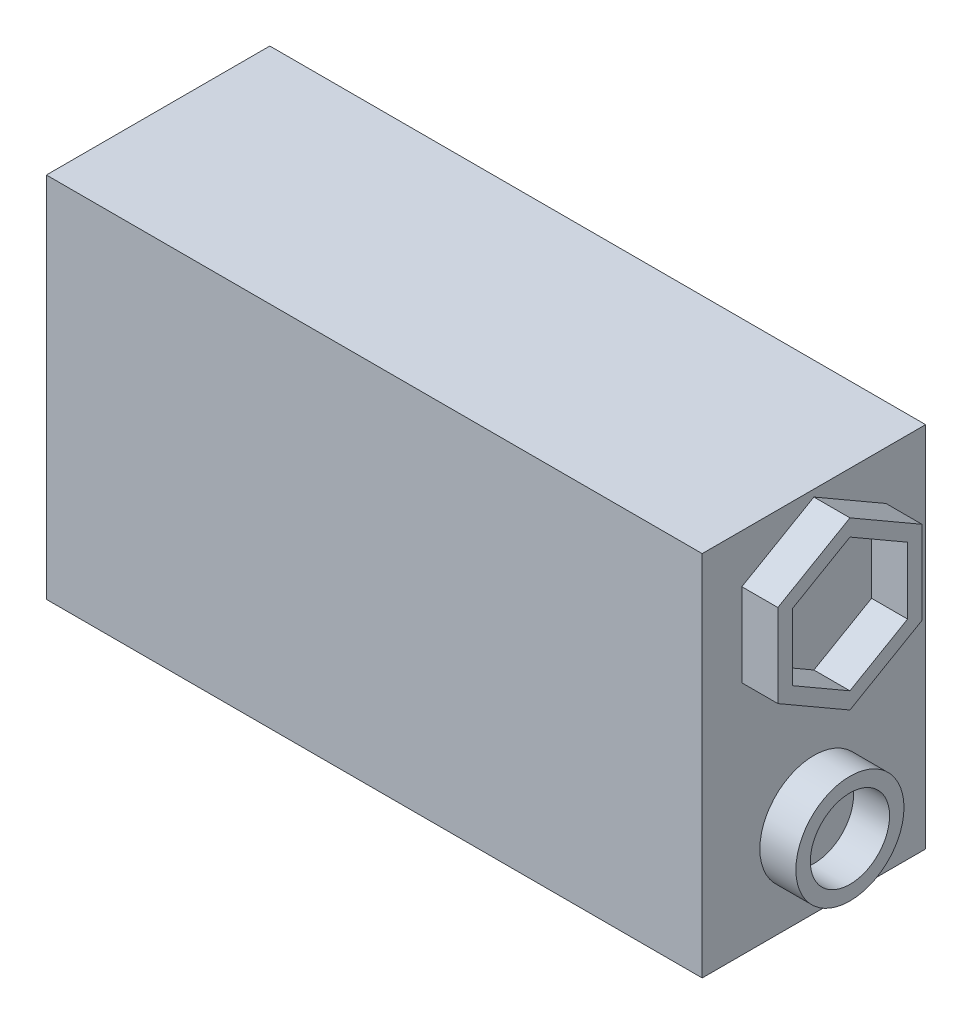
ISO-10303-21;
HEADER;
FILE_DESCRIPTION(('STEP AP214'),'2;1');
FILE_NAME('part.step','',(''),(''),'','','');
FILE_SCHEMA(('AUTOMOTIVE_DESIGN { 1 0 10303 214 1 1 1 1 }'));
ENDSEC;
DATA;
#1=APPLICATION_CONTEXT('core data for automotive mechanical design processes');
#2=APPLICATION_PROTOCOL_DEFINITION('international standard','automotive_design',2000,#1);
#3=PRODUCT_CONTEXT('',#1,'mechanical');
#4=PRODUCT('Part','Part','',(#3));
#5=PRODUCT_RELATED_PRODUCT_CATEGORY('part','',(#4));
#6=PRODUCT_DEFINITION_FORMATION('','',#4);
#7=PRODUCT_DEFINITION_CONTEXT('part definition',#1,'design');
#8=PRODUCT_DEFINITION('design','',#6,#7);
#9=PRODUCT_DEFINITION_SHAPE('','',#8);
#10=(LENGTH_UNIT() NAMED_UNIT(*) SI_UNIT(.MILLI.,.METRE.));
#11=(NAMED_UNIT(*) PLANE_ANGLE_UNIT() SI_UNIT($,.RADIAN.));
#12=(NAMED_UNIT(*) SI_UNIT($,.STERADIAN.) SOLID_ANGLE_UNIT());
#13=UNCERTAINTY_MEASURE_WITH_UNIT(LENGTH_MEASURE(1.E-05),#10,'distance_accuracy_value','');
#14=(GEOMETRIC_REPRESENTATION_CONTEXT(3) GLOBAL_UNCERTAINTY_ASSIGNED_CONTEXT((#13)) GLOBAL_UNIT_ASSIGNED_CONTEXT((#10,
#11,#12)) REPRESENTATION_CONTEXT('',''));
#15=CARTESIAN_POINT('',(0.,0.,0.));
#16=DIRECTION('',(0.,0.,1.));
#17=DIRECTION('',(1.,0.,0.));
#18=AXIS2_PLACEMENT_3D('',#15,#16,#17);
#19=CARTESIAN_POINT('',(22.75,-12.75,7.75));
#20=DIRECTION('',(-1.,0.,0.));
#21=DIRECTION('',(0.,0.,1.));
#22=AXIS2_PLACEMENT_3D('',#19,#20,#21);
#23=PLANE('',#22);
#24=CARTESIAN_POINT('',(22.75,-7.,0.));
#25=DIRECTION('',(-1.,0.,0.));
#26=DIRECTION('',(0.,0.,1.));
#27=AXIS2_PLACEMENT_3D('',#24,#25,#26);
#28=CIRCLE('',#27,3.75);
#29=CARTESIAN_POINT('',(22.75,-7.,3.75));
#30=VERTEX_POINT('',#29);
#31=EDGE_CURVE('E12',#30,#30,#28,.F.);
#32=ORIENTED_EDGE('',*,*,#31,.F.);
#33=EDGE_LOOP('',(#32));
#34=FACE_BOUND('',#33,.T.);
#35=DIRECTION('',(0.,1.,0.));
#36=VECTOR('',#35,1.);
#37=CARTESIAN_POINT('',(22.75,-12.75,-7.75));
#38=LINE('',#37,#36);
#39=CARTESIAN_POINT('',(22.75,-12.75,-7.75));
#40=VERTEX_POINT('',#39);
#41=CARTESIAN_POINT('',(22.75,12.75,-7.75));
#42=VERTEX_POINT('',#41);
#43=EDGE_CURVE('E332',#40,#42,#38,.T.);
#44=ORIENTED_EDGE('',*,*,#43,.T.);
#45=DIRECTION('',(0.,0.,-1.));
#46=VECTOR('',#45,1.);
#47=CARTESIAN_POINT('',(22.75,12.75,7.75));
#48=LINE('',#47,#46);
#49=CARTESIAN_POINT('',(22.75,12.75,7.75));
#50=VERTEX_POINT('',#49);
#51=EDGE_CURVE('E90',#50,#42,#48,.T.);
#52=ORIENTED_EDGE('',*,*,#51,.F.);
#53=DIRECTION('',(0.,1.,0.));
#54=VECTOR('',#53,1.);
#55=CARTESIAN_POINT('',(22.75,-12.75,7.75));
#56=LINE('',#55,#54);
#57=CARTESIAN_POINT('',(22.75,-12.75,7.75));
#58=VERTEX_POINT('',#57);
#59=EDGE_CURVE('E333',#58,#50,#56,.T.);
#60=ORIENTED_EDGE('',*,*,#59,.F.);
#61=DIRECTION('',(0.,0.,-1.));
#62=VECTOR('',#61,1.);
#63=CARTESIAN_POINT('',(22.75,-12.75,7.75));
#64=LINE('',#63,#62);
#65=EDGE_CURVE('E347',#58,#40,#64,.T.);
#66=ORIENTED_EDGE('',*,*,#65,.T.);
#67=EDGE_LOOP('',(#44,#52,#60,#66));
#68=FACE_BOUND('',#67,.T.);
#69=DIRECTION('',(0.,0.5,0.866025403784439));
#70=VECTOR('',#69,1.);
#71=CARTESIAN_POINT('',(22.75,9.67542648054295,-4.5));
#72=LINE('',#71,#70);
#73=CARTESIAN_POINT('',(22.75,9.38675134594813,-5.));
#74=VERTEX_POINT('',#73);
#75=CARTESIAN_POINT('',(22.75,12.2735026918963,0.));
#76=VERTEX_POINT('',#75);
#77=EDGE_CURVE('E97',#74,#76,#72,.T.);
#78=ORIENTED_EDGE('',*,*,#77,.F.);
#79=DIRECTION('',(0.,1.,0.));
#80=VECTOR('',#79,1.);
#81=CARTESIAN_POINT('',(22.75,4.1905989232415,-5.));
#82=LINE('',#81,#80);
#83=CARTESIAN_POINT('',(22.75,3.61324865405187,-5.));
#84=VERTEX_POINT('',#83);
#85=EDGE_CURVE('E101',#84,#74,#82,.T.);
#86=ORIENTED_EDGE('',*,*,#85,.F.);
#87=DIRECTION('',(0.,0.5,-0.866025403784439));
#88=VECTOR('',#87,1.);
#89=CARTESIAN_POINT('',(22.75,1.01517244269855,-0.499999999999999));
#90=LINE('',#89,#88);
#91=CARTESIAN_POINT('',(22.75,0.726497308103741,0.));
#92=VERTEX_POINT('',#91);
#93=EDGE_CURVE('E304',#92,#84,#90,.T.);
#94=ORIENTED_EDGE('',*,*,#93,.F.);
#95=DIRECTION('',(0.,-0.5,-0.866025403784439));
#96=VECTOR('',#95,1.);
#97=CARTESIAN_POINT('',(22.75,3.32457351945706,4.5));
#98=LINE('',#97,#96);
#99=CARTESIAN_POINT('',(22.75,3.61324865405187,5.));
#100=VERTEX_POINT('',#99);
#101=EDGE_CURVE('E300',#100,#92,#98,.T.);
#102=ORIENTED_EDGE('',*,*,#101,.F.);
#103=DIRECTION('',(0.,-1.,0.));
#104=VECTOR('',#103,1.);
#105=CARTESIAN_POINT('',(22.75,8.8094010767585,5.));
#106=LINE('',#105,#104);
#107=CARTESIAN_POINT('',(22.75,9.38675134594813,5.));
#108=VERTEX_POINT('',#107);
#109=EDGE_CURVE('E296',#108,#100,#106,.T.);
#110=ORIENTED_EDGE('',*,*,#109,.F.);
#111=DIRECTION('',(0.,-0.5,0.866025403784439));
#112=VECTOR('',#111,1.);
#113=CARTESIAN_POINT('',(22.75,11.9848275573014,0.499999999999998));
#114=LINE('',#113,#112);
#115=EDGE_CURVE('E292',#76,#108,#114,.T.);
#116=ORIENTED_EDGE('',*,*,#115,.F.);
#117=EDGE_LOOP('',(#78,#86,#94,#102,#110,#116));
#118=FACE_BOUND('',#117,.T.);
#119=ADVANCED_FACE('F81',(#34,#68,#118),#23,.F.);
#120=CARTESIAN_POINT('',(-22.75,12.75,7.75));
#121=DIRECTION('',(0.,-1.,0.));
#122=DIRECTION('',(0.,0.,-1.));
#123=AXIS2_PLACEMENT_3D('',#120,#121,#122);
#124=PLANE('',#123);
#125=DIRECTION('',(-1.,0.,0.));
#126=VECTOR('',#125,1.);
#127=CARTESIAN_POINT('',(-22.75,12.75,-7.75));
#128=LINE('',#127,#126);
#129=CARTESIAN_POINT('',(-22.75,12.75,-7.75));
#130=VERTEX_POINT('',#129);
#131=EDGE_CURVE('E351',#42,#130,#128,.T.);
#132=ORIENTED_EDGE('',*,*,#131,.T.);
#133=DIRECTION('',(0.,0.,-1.));
#134=VECTOR('',#133,1.);
#135=CARTESIAN_POINT('',(-22.75,12.75,7.75));
#136=LINE('',#135,#134);
#137=CARTESIAN_POINT('',(-22.75,12.75,7.75));
#138=VERTEX_POINT('',#137);
#139=EDGE_CURVE('E366',#138,#130,#136,.T.);
#140=ORIENTED_EDGE('',*,*,#139,.F.);
#141=DIRECTION('',(-1.,0.,0.));
#142=VECTOR('',#141,1.);
#143=CARTESIAN_POINT('',(-22.75,12.75,7.75));
#144=LINE('',#143,#142);
#145=EDGE_CURVE('E337',#50,#138,#144,.T.);
#146=ORIENTED_EDGE('',*,*,#145,.F.);
#147=ORIENTED_EDGE('',*,*,#51,.T.);
#148=EDGE_LOOP('',(#132,#140,#146,#147));
#149=FACE_BOUND('',#148,.T.);
#150=ADVANCED_FACE('F373',(#149),#124,.F.);
#151=CARTESIAN_POINT('',(-22.75,-12.75,7.75));
#152=DIRECTION('',(1.,0.,0.));
#153=DIRECTION('',(0.,0.,-1.));
#154=AXIS2_PLACEMENT_3D('',#151,#152,#153);
#155=PLANE('',#154);
#156=DIRECTION('',(0.,-1.,0.));
#157=VECTOR('',#156,1.);
#158=CARTESIAN_POINT('',(-22.75,-12.75,-7.75));
#159=LINE('',#158,#157);
#160=CARTESIAN_POINT('',(-22.75,-12.75,-7.75));
#161=VERTEX_POINT('',#160);
#162=EDGE_CURVE('E354',#130,#161,#159,.T.);
#163=ORIENTED_EDGE('',*,*,#162,.T.);
#164=DIRECTION('',(0.,0.,-1.));
#165=VECTOR('',#164,1.);
#166=CARTESIAN_POINT('',(-22.75,-12.75,7.75));
#167=LINE('',#166,#165);
#168=CARTESIAN_POINT('',(-22.75,-12.75,7.75));
#169=VERTEX_POINT('',#168);
#170=EDGE_CURVE('E362',#169,#161,#167,.T.);
#171=ORIENTED_EDGE('',*,*,#170,.F.);
#172=DIRECTION('',(0.,-1.,0.));
#173=VECTOR('',#172,1.);
#174=CARTESIAN_POINT('',(-22.75,-12.75,7.75));
#175=LINE('',#174,#173);
#176=EDGE_CURVE('E341',#138,#169,#175,.T.);
#177=ORIENTED_EDGE('',*,*,#176,.F.);
#178=ORIENTED_EDGE('',*,*,#139,.T.);
#179=EDGE_LOOP('',(#163,#171,#177,#178));
#180=FACE_BOUND('',#179,.T.);
#181=ADVANCED_FACE('F385',(#180),#155,.F.);
#182=CARTESIAN_POINT('',(-22.75,-12.75,7.75));
#183=DIRECTION('',(0.,1.,0.));
#184=DIRECTION('',(0.,0.,1.));
#185=AXIS2_PLACEMENT_3D('',#182,#183,#184);
#186=PLANE('',#185);
#187=DIRECTION('',(1.,0.,0.));
#188=VECTOR('',#187,1.);
#189=CARTESIAN_POINT('',(-22.75,-12.75,-7.75));
#190=LINE('',#189,#188);
#191=EDGE_CURVE('E338',#161,#40,#190,.T.);
#192=ORIENTED_EDGE('',*,*,#191,.T.);
#193=ORIENTED_EDGE('',*,*,#65,.F.);
#194=DIRECTION('',(1.,0.,0.));
#195=VECTOR('',#194,1.);
#196=CARTESIAN_POINT('',(-22.75,-12.75,7.75));
#197=LINE('',#196,#195);
#198=EDGE_CURVE('E344',#169,#58,#197,.T.);
#199=ORIENTED_EDGE('',*,*,#198,.F.);
#200=ORIENTED_EDGE('',*,*,#170,.T.);
#201=EDGE_LOOP('',(#192,#193,#199,#200));
#202=FACE_BOUND('',#201,.T.);
#203=ADVANCED_FACE('F389',(#202),#186,.F.);
#204=CARTESIAN_POINT('',(0.,0.,7.75));
#205=DIRECTION('',(0.,0.,-1.));
#206=DIRECTION('',(-1.,0.,0.));
#207=AXIS2_PLACEMENT_3D('',#204,#205,#206);
#208=PLANE('',#207);
#209=ORIENTED_EDGE('',*,*,#59,.T.);
#210=ORIENTED_EDGE('',*,*,#145,.T.);
#211=ORIENTED_EDGE('',*,*,#176,.T.);
#212=ORIENTED_EDGE('',*,*,#198,.T.);
#213=EDGE_LOOP('',(#209,#210,#211,#212));
#214=FACE_BOUND('',#213,.T.);
#215=ADVANCED_FACE('F391',(#214),#208,.F.);
#216=CARTESIAN_POINT('',(0.,0.,-7.75));
#217=DIRECTION('',(0.,0.,-1.));
#218=DIRECTION('',(-1.,0.,0.));
#219=AXIS2_PLACEMENT_3D('',#216,#217,#218);
#220=PLANE('',#219);
#221=ORIENTED_EDGE('',*,*,#43,.F.);
#222=ORIENTED_EDGE('',*,*,#191,.F.);
#223=ORIENTED_EDGE('',*,*,#162,.F.);
#224=ORIENTED_EDGE('',*,*,#131,.F.);
#225=EDGE_LOOP('',(#221,#222,#223,#224));
#226=FACE_BOUND('',#225,.T.);
#227=ADVANCED_FACE('F381',(#226),#220,.T.);
#228=CARTESIAN_POINT('',(25.25,0.,0.));
#229=DIRECTION('',(1.,0.,0.));
#230=DIRECTION('',(0.,0.,-1.));
#231=AXIS2_PLACEMENT_3D('',#228,#229,#230);
#232=PLANE('',#231);
#233=DIRECTION('',(0.,0.5,0.866025403784439));
#234=VECTOR('',#233,1.);
#235=CARTESIAN_POINT('',(25.25,9.67542648054295,-4.5));
#236=LINE('',#235,#234);
#237=CARTESIAN_POINT('',(25.25,9.38675134594813,-5.));
#238=VERTEX_POINT('',#237);
#239=CARTESIAN_POINT('',(25.25,12.2735026918963,0.));
#240=VERTEX_POINT('',#239);
#241=EDGE_CURVE('E270',#238,#240,#236,.T.);
#242=ORIENTED_EDGE('',*,*,#241,.T.);
#243=DIRECTION('',(0.,-0.5,0.866025403784439));
#244=VECTOR('',#243,1.);
#245=CARTESIAN_POINT('',(25.25,11.9848275573014,0.499999999999998));
#246=LINE('',#245,#244);
#247=CARTESIAN_POINT('',(25.25,9.38675134594813,5.));
#248=VERTEX_POINT('',#247);
#249=EDGE_CURVE('E274',#240,#248,#246,.T.);
#250=ORIENTED_EDGE('',*,*,#249,.T.);
#251=DIRECTION('',(0.,-1.,0.));
#252=VECTOR('',#251,1.);
#253=CARTESIAN_POINT('',(25.25,8.8094010767585,5.));
#254=LINE('',#253,#252);
#255=CARTESIAN_POINT('',(25.25,3.61324865405187,5.));
#256=VERTEX_POINT('',#255);
#257=EDGE_CURVE('E277',#248,#256,#254,.T.);
#258=ORIENTED_EDGE('',*,*,#257,.T.);
#259=DIRECTION('',(0.,-0.5,-0.866025403784439));
#260=VECTOR('',#259,1.);
#261=CARTESIAN_POINT('',(25.25,3.32457351945706,4.5));
#262=LINE('',#261,#260);
#263=CARTESIAN_POINT('',(25.25,0.726497308103741,0.));
#264=VERTEX_POINT('',#263);
#265=EDGE_CURVE('E280',#256,#264,#262,.T.);
#266=ORIENTED_EDGE('',*,*,#265,.T.);
#267=DIRECTION('',(0.,0.5,-0.866025403784439));
#268=VECTOR('',#267,1.);
#269=CARTESIAN_POINT('',(25.25,1.01517244269855,-0.499999999999999));
#270=LINE('',#269,#268);
#271=CARTESIAN_POINT('',(25.25,3.61324865405187,-5.));
#272=VERTEX_POINT('',#271);
#273=EDGE_CURVE('E283',#264,#272,#270,.T.);
#274=ORIENTED_EDGE('',*,*,#273,.T.);
#275=DIRECTION('',(0.,1.,0.));
#276=VECTOR('',#275,1.);
#277=CARTESIAN_POINT('',(25.25,4.1905989232415,-5.));
#278=LINE('',#277,#276);
#279=EDGE_CURVE('E286',#272,#238,#278,.T.);
#280=ORIENTED_EDGE('',*,*,#279,.T.);
#281=EDGE_LOOP('',(#242,#250,#258,#266,#274,#280));
#282=FACE_BOUND('',#281,.T.);
#283=DIRECTION('',(0.,-0.5,0.866025403784439));
#284=VECTOR('',#283,1.);
#285=CARTESIAN_POINT('',(25.25,11.118802153517,0.));
#286=LINE('',#285,#284);
#287=CARTESIAN_POINT('',(25.25,11.118802153517,0.));
#288=VERTEX_POINT('',#287);
#289=CARTESIAN_POINT('',(25.25,8.8094010767585,4.));
#290=VERTEX_POINT('',#289);
#291=EDGE_CURVE('E205',#288,#290,#286,.T.);
#292=ORIENTED_EDGE('',*,*,#291,.F.);
#293=DIRECTION('',(0.,0.5,0.866025403784438));
#294=VECTOR('',#293,1.);
#295=CARTESIAN_POINT('',(25.25,8.80940107675851,-4.));
#296=LINE('',#295,#294);
#297=CARTESIAN_POINT('',(25.25,8.80940107675851,-4.));
#298=VERTEX_POINT('',#297);
#299=EDGE_CURVE('E194',#298,#288,#296,.T.);
#300=ORIENTED_EDGE('',*,*,#299,.F.);
#301=DIRECTION('',(0.,1.,0.));
#302=VECTOR('',#301,1.);
#303=CARTESIAN_POINT('',(25.25,4.1905989232415,-4.));
#304=LINE('',#303,#302);
#305=CARTESIAN_POINT('',(25.25,4.1905989232415,-4.));
#306=VERTEX_POINT('',#305);
#307=EDGE_CURVE('E233',#306,#298,#304,.T.);
#308=ORIENTED_EDGE('',*,*,#307,.F.);
#309=DIRECTION('',(0.,0.5,-0.866025403784439));
#310=VECTOR('',#309,1.);
#311=CARTESIAN_POINT('',(25.25,1.88119784648299,0.));
#312=LINE('',#311,#310);
#313=CARTESIAN_POINT('',(25.25,1.88119784648299,0.));
#314=VERTEX_POINT('',#313);
#315=EDGE_CURVE('E229',#314,#306,#312,.T.);
#316=ORIENTED_EDGE('',*,*,#315,.F.);
#317=DIRECTION('',(0.,-0.5,-0.866025403784439));
#318=VECTOR('',#317,1.);
#319=CARTESIAN_POINT('',(25.25,4.1905989232415,4.));
#320=LINE('',#319,#318);
#321=CARTESIAN_POINT('',(25.25,4.1905989232415,4.));
#322=VERTEX_POINT('',#321);
#323=EDGE_CURVE('E223',#322,#314,#320,.T.);
#324=ORIENTED_EDGE('',*,*,#323,.F.);
#325=DIRECTION('',(0.,-1.,0.));
#326=VECTOR('',#325,1.);
#327=CARTESIAN_POINT('',(25.25,8.8094010767585,4.));
#328=LINE('',#327,#326);
#329=EDGE_CURVE('E219',#290,#322,#328,.T.);
#330=ORIENTED_EDGE('',*,*,#329,.F.);
#331=EDGE_LOOP('',(#292,#300,#308,#316,#324,#330));
#332=FACE_BOUND('',#331,.T.);
#333=ADVANCED_FACE('F217',(#282,#332),#232,.T.);
#334=CARTESIAN_POINT('',(25.25,9.67542648054295,-4.5));
#335=DIRECTION('',(0.,-0.866025403784438,0.5));
#336=DIRECTION('',(0.,-0.5,-0.866025403784438));
#337=AXIS2_PLACEMENT_3D('',#334,#335,#336);
#338=PLANE('',#337);
#339=ORIENTED_EDGE('',*,*,#77,.T.);
#340=DIRECTION('',(-1.,0.,0.));
#341=VECTOR('',#340,1.);
#342=CARTESIAN_POINT('',(25.25,12.2735026918963,0.));
#343=LINE('',#342,#341);
#344=EDGE_CURVE('E328',#240,#76,#343,.T.);
#345=ORIENTED_EDGE('',*,*,#344,.F.);
#346=ORIENTED_EDGE('',*,*,#241,.F.);
#347=DIRECTION('',(-1.,0.,0.));
#348=VECTOR('',#347,1.);
#349=CARTESIAN_POINT('',(25.25,9.38675134594813,-5.));
#350=LINE('',#349,#348);
#351=EDGE_CURVE('E289',#238,#74,#350,.T.);
#352=ORIENTED_EDGE('',*,*,#351,.T.);
#353=EDGE_LOOP('',(#339,#345,#346,#352));
#354=FACE_BOUND('',#353,.T.);
#355=ADVANCED_FACE('F467',(#354),#338,.F.);
#356=CARTESIAN_POINT('',(25.25,11.9848275573014,0.499999999999998));
#357=DIRECTION('',(0.,-0.866025403784438,-0.5));
#358=DIRECTION('',(0.,0.5,-0.866025403784438));
#359=AXIS2_PLACEMENT_3D('',#356,#357,#358);
#360=PLANE('',#359);
#361=ORIENTED_EDGE('',*,*,#115,.T.);
#362=DIRECTION('',(-1.,0.,0.));
#363=VECTOR('',#362,1.);
#364=CARTESIAN_POINT('',(25.25,9.38675134594813,5.));
#365=LINE('',#364,#363);
#366=EDGE_CURVE('E324',#248,#108,#365,.T.);
#367=ORIENTED_EDGE('',*,*,#366,.F.);
#368=ORIENTED_EDGE('',*,*,#249,.F.);
#369=ORIENTED_EDGE('',*,*,#344,.T.);
#370=EDGE_LOOP('',(#361,#367,#368,#369));
#371=FACE_BOUND('',#370,.T.);
#372=ADVANCED_FACE('F483',(#371),#360,.F.);
#373=CARTESIAN_POINT('',(25.25,8.8094010767585,5.));
#374=DIRECTION('',(0.,0.,-1.));
#375=DIRECTION('',(-1.,0.,0.));
#376=AXIS2_PLACEMENT_3D('',#373,#374,#375);
#377=PLANE('',#376);
#378=ORIENTED_EDGE('',*,*,#109,.T.);
#379=DIRECTION('',(-1.,0.,0.));
#380=VECTOR('',#379,1.);
#381=CARTESIAN_POINT('',(25.25,3.61324865405187,5.));
#382=LINE('',#381,#380);
#383=EDGE_CURVE('E320',#256,#100,#382,.T.);
#384=ORIENTED_EDGE('',*,*,#383,.F.);
#385=ORIENTED_EDGE('',*,*,#257,.F.);
#386=ORIENTED_EDGE('',*,*,#366,.T.);
#387=EDGE_LOOP('',(#378,#384,#385,#386));
#388=FACE_BOUND('',#387,.T.);
#389=ADVANCED_FACE('F479',(#388),#377,.F.);
#390=CARTESIAN_POINT('',(25.25,3.32457351945706,4.5));
#391=DIRECTION('',(0.,0.866025403784439,-0.5));
#392=DIRECTION('',(0.,0.5,0.866025403784439));
#393=AXIS2_PLACEMENT_3D('',#390,#391,#392);
#394=PLANE('',#393);
#395=ORIENTED_EDGE('',*,*,#101,.T.);
#396=DIRECTION('',(-1.,0.,0.));
#397=VECTOR('',#396,1.);
#398=CARTESIAN_POINT('',(25.25,0.726497308103741,0.));
#399=LINE('',#398,#397);
#400=EDGE_CURVE('E316',#264,#92,#399,.T.);
#401=ORIENTED_EDGE('',*,*,#400,.F.);
#402=ORIENTED_EDGE('',*,*,#265,.F.);
#403=ORIENTED_EDGE('',*,*,#383,.T.);
#404=EDGE_LOOP('',(#395,#401,#402,#403));
#405=FACE_BOUND('',#404,.T.);
#406=ADVANCED_FACE('F475',(#405),#394,.F.);
#407=CARTESIAN_POINT('',(25.25,1.01517244269855,-0.499999999999999));
#408=DIRECTION('',(0.,0.866025403784439,0.5));
#409=DIRECTION('',(0.,-0.5,0.866025403784439));
#410=AXIS2_PLACEMENT_3D('',#407,#408,#409);
#411=PLANE('',#410);
#412=ORIENTED_EDGE('',*,*,#93,.T.);
#413=DIRECTION('',(-1.,0.,0.));
#414=VECTOR('',#413,1.);
#415=CARTESIAN_POINT('',(25.25,3.61324865405187,-5.));
#416=LINE('',#415,#414);
#417=EDGE_CURVE('E312',#272,#84,#416,.T.);
#418=ORIENTED_EDGE('',*,*,#417,.F.);
#419=ORIENTED_EDGE('',*,*,#273,.F.);
#420=ORIENTED_EDGE('',*,*,#400,.T.);
#421=EDGE_LOOP('',(#412,#418,#419,#420));
#422=FACE_BOUND('',#421,.T.);
#423=ADVANCED_FACE('F471',(#422),#411,.F.);
#424=CARTESIAN_POINT('',(25.25,4.1905989232415,-5.));
#425=DIRECTION('',(0.,0.,1.));
#426=DIRECTION('',(1.,0.,0.));
#427=AXIS2_PLACEMENT_3D('',#424,#425,#426);
#428=PLANE('',#427);
#429=ORIENTED_EDGE('',*,*,#85,.T.);
#430=ORIENTED_EDGE('',*,*,#351,.F.);
#431=ORIENTED_EDGE('',*,*,#279,.F.);
#432=ORIENTED_EDGE('',*,*,#417,.T.);
#433=EDGE_LOOP('',(#429,#430,#431,#432));
#434=FACE_BOUND('',#433,.T.);
#435=ADVANCED_FACE('F464',(#434),#428,.F.);
#436=CARTESIAN_POINT('',(25.25,8.80940107675851,-4.));
#437=DIRECTION('',(0.,-0.866025403784438,0.5));
#438=DIRECTION('',(0.,-0.5,-0.866025403784439));
#439=AXIS2_PLACEMENT_3D('',#436,#437,#438);
#440=PLANE('',#439);
#441=DIRECTION('',(0.,0.5,0.866025403784438));
#442=VECTOR('',#441,1.);
#443=CARTESIAN_POINT('',(22.75,8.80940107675851,-4.));
#444=LINE('',#443,#442);
#445=CARTESIAN_POINT('',(22.75,8.80940107675851,-4.));
#446=VERTEX_POINT('',#445);
#447=CARTESIAN_POINT('',(22.75,11.118802153517,0.));
#448=VERTEX_POINT('',#447);
#449=EDGE_CURVE('E236',#446,#448,#444,.T.);
#450=ORIENTED_EDGE('',*,*,#449,.F.);
#451=DIRECTION('',(-1.,0.,0.));
#452=VECTOR('',#451,1.);
#453=CARTESIAN_POINT('',(25.25,8.80940107675851,-4.));
#454=LINE('',#453,#452);
#455=EDGE_CURVE('E200',#298,#446,#454,.T.);
#456=ORIENTED_EDGE('',*,*,#455,.F.);
#457=ORIENTED_EDGE('',*,*,#299,.T.);
#458=DIRECTION('',(-1.,0.,0.));
#459=VECTOR('',#458,1.);
#460=CARTESIAN_POINT('',(25.25,11.118802153517,0.));
#461=LINE('',#460,#459);
#462=EDGE_CURVE('E198',#288,#448,#461,.T.);
#463=ORIENTED_EDGE('',*,*,#462,.T.);
#464=EDGE_LOOP('',(#450,#456,#457,#463));
#465=FACE_BOUND('',#464,.T.);
#466=ADVANCED_FACE('F197',(#465),#440,.T.);
#467=CARTESIAN_POINT('',(25.25,11.118802153517,0.));
#468=DIRECTION('',(0.,-0.866025403784438,-0.5));
#469=DIRECTION('',(0.,0.5,-0.866025403784438));
#470=AXIS2_PLACEMENT_3D('',#467,#468,#469);
#471=PLANE('',#470);
#472=DIRECTION('',(0.,-0.5,0.866025403784439));
#473=VECTOR('',#472,1.);
#474=CARTESIAN_POINT('',(22.75,11.118802153517,0.));
#475=LINE('',#474,#473);
#476=CARTESIAN_POINT('',(22.75,8.8094010767585,4.));
#477=VERTEX_POINT('',#476);
#478=EDGE_CURVE('E212',#448,#477,#475,.T.);
#479=ORIENTED_EDGE('',*,*,#478,.F.);
#480=ORIENTED_EDGE('',*,*,#462,.F.);
#481=ORIENTED_EDGE('',*,*,#291,.T.);
#482=DIRECTION('',(-1.,0.,0.));
#483=VECTOR('',#482,1.);
#484=CARTESIAN_POINT('',(25.25,8.8094010767585,4.));
#485=LINE('',#484,#483);
#486=EDGE_CURVE('E214',#290,#477,#485,.T.);
#487=ORIENTED_EDGE('',*,*,#486,.T.);
#488=EDGE_LOOP('',(#479,#480,#481,#487));
#489=FACE_BOUND('',#488,.T.);
#490=ADVANCED_FACE('F209',(#489),#471,.T.);
#491=CARTESIAN_POINT('',(25.25,8.8094010767585,4.));
#492=DIRECTION('',(0.,0.,-1.));
#493=DIRECTION('',(-1.,0.,0.));
#494=AXIS2_PLACEMENT_3D('',#491,#492,#493);
#495=PLANE('',#494);
#496=DIRECTION('',(0.,-1.,0.));
#497=VECTOR('',#496,1.);
#498=CARTESIAN_POINT('',(22.75,8.8094010767585,4.));
#499=LINE('',#498,#497);
#500=CARTESIAN_POINT('',(22.75,4.1905989232415,4.));
#501=VERTEX_POINT('',#500);
#502=EDGE_CURVE('E242',#477,#501,#499,.T.);
#503=ORIENTED_EDGE('',*,*,#502,.F.);
#504=ORIENTED_EDGE('',*,*,#486,.F.);
#505=ORIENTED_EDGE('',*,*,#329,.T.);
#506=DIRECTION('',(-1.,0.,0.));
#507=VECTOR('',#506,1.);
#508=CARTESIAN_POINT('',(25.25,4.1905989232415,4.));
#509=LINE('',#508,#507);
#510=EDGE_CURVE('E265',#322,#501,#509,.T.);
#511=ORIENTED_EDGE('',*,*,#510,.T.);
#512=EDGE_LOOP('',(#503,#504,#505,#511));
#513=FACE_BOUND('',#512,.T.);
#514=ADVANCED_FACE('F455',(#513),#495,.T.);
#515=CARTESIAN_POINT('',(25.25,4.1905989232415,4.));
#516=DIRECTION('',(0.,0.866025403784439,-0.5));
#517=DIRECTION('',(0.,0.5,0.866025403784439));
#518=AXIS2_PLACEMENT_3D('',#515,#516,#517);
#519=PLANE('',#518);
#520=DIRECTION('',(0.,-0.5,-0.866025403784439));
#521=VECTOR('',#520,1.);
#522=CARTESIAN_POINT('',(22.75,4.1905989232415,4.));
#523=LINE('',#522,#521);
#524=CARTESIAN_POINT('',(22.75,1.88119784648299,0.));
#525=VERTEX_POINT('',#524);
#526=EDGE_CURVE('E246',#501,#525,#523,.T.);
#527=ORIENTED_EDGE('',*,*,#526,.F.);
#528=ORIENTED_EDGE('',*,*,#510,.F.);
#529=ORIENTED_EDGE('',*,*,#323,.T.);
#530=DIRECTION('',(-1.,0.,0.));
#531=VECTOR('',#530,1.);
#532=CARTESIAN_POINT('',(25.25,1.88119784648299,0.));
#533=LINE('',#532,#531);
#534=EDGE_CURVE('E262',#314,#525,#533,.T.);
#535=ORIENTED_EDGE('',*,*,#534,.T.);
#536=EDGE_LOOP('',(#527,#528,#529,#535));
#537=FACE_BOUND('',#536,.T.);
#538=ADVANCED_FACE('F451',(#537),#519,.T.);
#539=CARTESIAN_POINT('',(25.25,1.88119784648299,0.));
#540=DIRECTION('',(0.,0.866025403784439,0.5));
#541=DIRECTION('',(0.,-0.5,0.866025403784439));
#542=AXIS2_PLACEMENT_3D('',#539,#540,#541);
#543=PLANE('',#542);
#544=DIRECTION('',(0.,0.5,-0.866025403784439));
#545=VECTOR('',#544,1.);
#546=CARTESIAN_POINT('',(22.75,1.88119784648299,0.));
#547=LINE('',#546,#545);
#548=CARTESIAN_POINT('',(22.75,4.1905989232415,-4.));
#549=VERTEX_POINT('',#548);
#550=EDGE_CURVE('E250',#525,#549,#547,.T.);
#551=ORIENTED_EDGE('',*,*,#550,.F.);
#552=ORIENTED_EDGE('',*,*,#534,.F.);
#553=ORIENTED_EDGE('',*,*,#315,.T.);
#554=DIRECTION('',(-1.,0.,0.));
#555=VECTOR('',#554,1.);
#556=CARTESIAN_POINT('',(25.25,4.1905989232415,-4.));
#557=LINE('',#556,#555);
#558=EDGE_CURVE('E259',#306,#549,#557,.T.);
#559=ORIENTED_EDGE('',*,*,#558,.T.);
#560=EDGE_LOOP('',(#551,#552,#553,#559));
#561=FACE_BOUND('',#560,.T.);
#562=ADVANCED_FACE('F447',(#561),#543,.T.);
#563=CARTESIAN_POINT('',(25.25,4.1905989232415,-4.));
#564=DIRECTION('',(0.,0.,1.));
#565=DIRECTION('',(1.,0.,0.));
#566=AXIS2_PLACEMENT_3D('',#563,#564,#565);
#567=PLANE('',#566);
#568=DIRECTION('',(0.,1.,0.));
#569=VECTOR('',#568,1.);
#570=CARTESIAN_POINT('',(22.75,4.1905989232415,-4.));
#571=LINE('',#570,#569);
#572=EDGE_CURVE('E206',#549,#446,#571,.T.);
#573=ORIENTED_EDGE('',*,*,#572,.F.);
#574=ORIENTED_EDGE('',*,*,#558,.F.);
#575=ORIENTED_EDGE('',*,*,#307,.T.);
#576=ORIENTED_EDGE('',*,*,#455,.T.);
#577=EDGE_LOOP('',(#573,#574,#575,#576));
#578=FACE_BOUND('',#577,.T.);
#579=ADVANCED_FACE('F410',(#578),#567,.T.);
#580=ORIENTED_EDGE('',*,*,#572,.T.);
#581=ORIENTED_EDGE('',*,*,#449,.T.);
#582=ORIENTED_EDGE('',*,*,#478,.T.);
#583=ORIENTED_EDGE('',*,*,#502,.T.);
#584=ORIENTED_EDGE('',*,*,#526,.T.);
#585=ORIENTED_EDGE('',*,*,#550,.T.);
#586=EDGE_LOOP('',(#580,#581,#582,#583,#584,#585));
#587=FACE_BOUND('',#586,.T.);
#588=ADVANCED_FACE('F83',(#587),#23,.F.);
#589=CARTESIAN_POINT('',(25.25,-7.,0.));
#590=DIRECTION('',(1.,0.,0.));
#591=DIRECTION('',(0.,0.,-1.));
#592=AXIS2_PLACEMENT_3D('',#589,#590,#591);
#593=PLANE('',#592);
#594=CARTESIAN_POINT('',(25.25,-7.,0.));
#595=DIRECTION('',(1.,0.,0.));
#596=DIRECTION('',(0.,0.,-1.));
#597=AXIS2_PLACEMENT_3D('',#594,#595,#596);
#598=CIRCLE('',#597,3.75);
#599=CARTESIAN_POINT('',(25.25,-7.,-3.75));
#600=VERTEX_POINT('',#599);
#601=EDGE_CURVE('E239',#600,#600,#598,.T.);
#602=ORIENTED_EDGE('',*,*,#601,.T.);
#603=EDGE_LOOP('',(#602));
#604=FACE_BOUND('',#603,.T.);
#605=CARTESIAN_POINT('',(25.25,-7.,0.));
#606=DIRECTION('',(1.,0.,0.));
#607=DIRECTION('',(0.,0.,-1.));
#608=AXIS2_PLACEMENT_3D('',#605,#606,#607);
#609=CIRCLE('',#608,2.75);
#610=CARTESIAN_POINT('',(25.25,-7.,-2.75));
#611=VERTEX_POINT('',#610);
#612=EDGE_CURVE('E426',#611,#611,#609,.T.);
#613=ORIENTED_EDGE('',*,*,#612,.F.);
#614=EDGE_LOOP('',(#613));
#615=FACE_BOUND('',#614,.T.);
#616=ADVANCED_FACE('F409',(#604,#615),#593,.T.);
#617=CARTESIAN_POINT('',(25.25,-7.,0.));
#618=DIRECTION('',(-1.,0.,0.));
#619=DIRECTION('',(0.,0.,1.));
#620=AXIS2_PLACEMENT_3D('',#617,#618,#619);
#621=CYLINDRICAL_SURFACE('',#620,3.75);
#622=ORIENTED_EDGE('',*,*,#601,.F.);
#623=EDGE_LOOP('',(#622));
#624=FACE_BOUND('',#623,.T.);
#625=ORIENTED_EDGE('',*,*,#31,.T.);
#626=EDGE_LOOP('',(#625));
#627=FACE_BOUND('',#626,.T.);
#628=ADVANCED_FACE('F418',(#624,#627),#621,.T.);
#629=CARTESIAN_POINT('',(25.25,-7.,0.));
#630=DIRECTION('',(-1.,0.,0.));
#631=DIRECTION('',(0.,0.,1.));
#632=AXIS2_PLACEMENT_3D('',#629,#630,#631);
#633=CYLINDRICAL_SURFACE('',#632,2.75);
#634=ORIENTED_EDGE('',*,*,#612,.T.);
#635=EDGE_LOOP('',(#634));
#636=FACE_BOUND('',#635,.T.);
#637=CARTESIAN_POINT('',(22.75,-7.,0.));
#638=DIRECTION('',(1.,0.,0.));
#639=DIRECTION('',(0.,0.,-1.));
#640=AXIS2_PLACEMENT_3D('',#637,#638,#639);
#641=CIRCLE('',#640,2.75);
#642=CARTESIAN_POINT('',(22.75,-7.,-2.75));
#643=VERTEX_POINT('',#642);
#644=EDGE_CURVE('E423',#643,#643,#641,.T.);
#645=ORIENTED_EDGE('',*,*,#644,.F.);
#646=EDGE_LOOP('',(#645));
#647=FACE_BOUND('',#646,.T.);
#648=ADVANCED_FACE('F413',(#636,#647),#633,.F.);
#649=ORIENTED_EDGE('',*,*,#644,.T.);
#650=EDGE_LOOP('',(#649));
#651=FACE_BOUND('',#650,.T.);
#652=ADVANCED_FACE('F403',(#651),#23,.F.);
#653=CLOSED_SHELL('',(#119,#150,#181,#203,#215,#227,#333,#355,#372,#389,#406,#423,#435,#466,
#490,#514,#538,#562,#579,#588,#616,#628,#648,#652));
#654=MANIFOLD_SOLID_BREP('B2',#653);
#655=ADVANCED_BREP_SHAPE_REPRESENTATION('',(#18,#654),#14);
#656=SHAPE_DEFINITION_REPRESENTATION(#9,#655);
ENDSEC;
END-ISO-10303-21;
